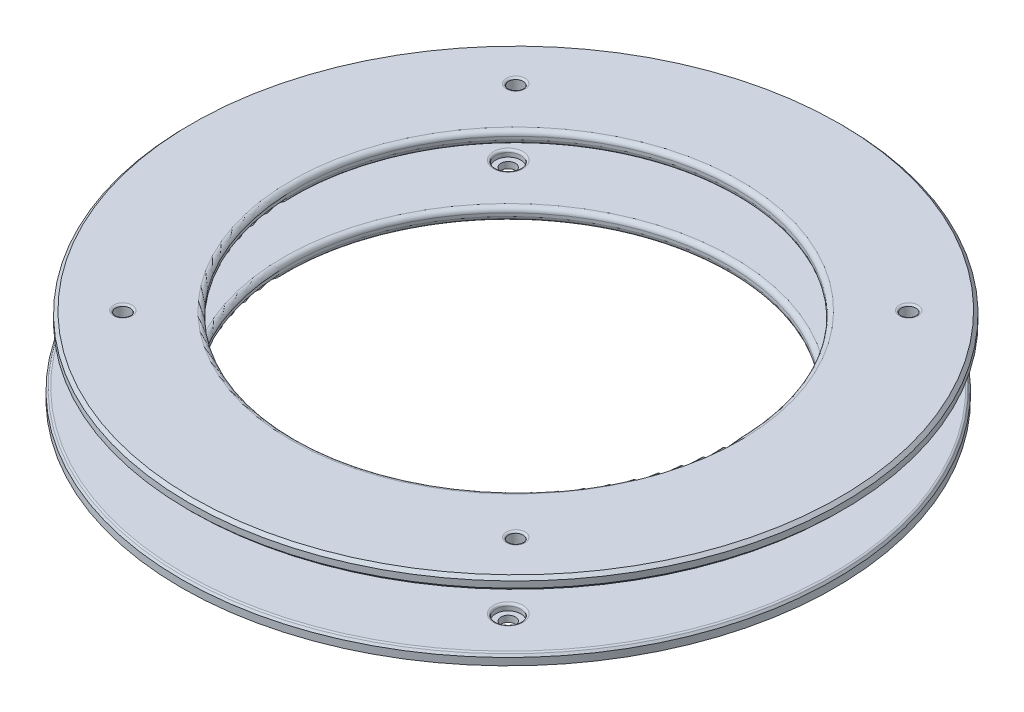
ISO-10303-21;
HEADER;
FILE_DESCRIPTION(('STEP AP214'),'2;1');
FILE_NAME('part.step','',(''),(''),'','','');
FILE_SCHEMA(('AUTOMOTIVE_DESIGN { 1 0 10303 214 1 1 1 1 }'));
ENDSEC;
DATA;
#1=APPLICATION_CONTEXT('core data for automotive mechanical design processes');
#2=APPLICATION_PROTOCOL_DEFINITION('international standard','automotive_design',2000,#1);
#3=PRODUCT_CONTEXT('',#1,'mechanical');
#4=PRODUCT('Part','Part','',(#3));
#5=PRODUCT_RELATED_PRODUCT_CATEGORY('part','',(#4));
#6=PRODUCT_DEFINITION_FORMATION('','',#4);
#7=PRODUCT_DEFINITION_CONTEXT('part definition',#1,'design');
#8=PRODUCT_DEFINITION('design','',#6,#7);
#9=PRODUCT_DEFINITION_SHAPE('','',#8);
#10=(LENGTH_UNIT() NAMED_UNIT(*) SI_UNIT(.MILLI.,.METRE.));
#11=(NAMED_UNIT(*) PLANE_ANGLE_UNIT() SI_UNIT($,.RADIAN.));
#12=(NAMED_UNIT(*) SI_UNIT($,.STERADIAN.) SOLID_ANGLE_UNIT());
#13=UNCERTAINTY_MEASURE_WITH_UNIT(LENGTH_MEASURE(1.E-05),#10,'distance_accuracy_value','');
#14=(GEOMETRIC_REPRESENTATION_CONTEXT(3) GLOBAL_UNCERTAINTY_ASSIGNED_CONTEXT((#13)) GLOBAL_UNIT_ASSIGNED_CONTEXT((#10,
#11,#12)) REPRESENTATION_CONTEXT('',''));
#15=CARTESIAN_POINT('',(0.,0.,0.));
#16=DIRECTION('',(0.,0.,1.));
#17=DIRECTION('',(1.,0.,0.));
#18=AXIS2_PLACEMENT_3D('',#15,#16,#17);
#19=CARTESIAN_POINT('',(-12.6429812739192,30.026931653807,102.095432399464));
#20=DIRECTION('',(0.,-1.,0.));
#21=DIRECTION('',(0.,0.,-1.));
#22=AXIS2_PLACEMENT_3D('',#19,#20,#21);
#23=CYLINDRICAL_SURFACE('',#22,104.);
#24=CARTESIAN_POINT('',(-12.6429812739192,27.026931653807,102.095432399464));
#25=DIRECTION('',(0.,1.,0.));
#26=DIRECTION('',(0.,0.,1.));
#27=AXIS2_PLACEMENT_3D('',#24,#25,#26);
#28=CIRCLE('',#27,104.);
#29=CARTESIAN_POINT('',(-12.6429812739192,27.026931653807,206.095432399464));
#30=VERTEX_POINT('',#29);
#31=EDGE_CURVE('P0_E41',#30,#30,#28,.T.);
#32=ORIENTED_EDGE('',*,*,#31,.T.);
#33=EDGE_LOOP('',(#32));
#34=FACE_BOUND('',#33,.T.);
#35=CARTESIAN_POINT('',(-12.6429812739192,29.026931653807,102.095432399464));
#36=DIRECTION('',(0.,1.,0.));
#37=DIRECTION('',(0.,0.,1.));
#38=AXIS2_PLACEMENT_3D('',#35,#36,#37);
#39=CIRCLE('',#38,104.);
#40=CARTESIAN_POINT('',(-12.6429812739192,29.026931653807,206.095432399464));
#41=VERTEX_POINT('',#40);
#42=EDGE_CURVE('P0_E44',#41,#41,#39,.F.);
#43=ORIENTED_EDGE('',*,*,#42,.T.);
#44=EDGE_LOOP('',(#43));
#45=FACE_BOUND('',#44,.T.);
#46=ADVANCED_FACE('P0_F15',(#34,#45),#23,.T.);
#47=CARTESIAN_POINT('',(-12.6429812739192,30.026931653807,102.095432399464));
#48=DIRECTION('',(0.,1.,0.));
#49=DIRECTION('',(0.,0.,1.));
#50=AXIS2_PLACEMENT_3D('',#47,#48,#49);
#51=PLANE('',#50);
#52=CARTESIAN_POINT('',(-75.1429812739192,30.026931653807,164.595432399464));
#53=DIRECTION('',(0.,1.,0.));
#54=DIRECTION('',(0.,0.,1.));
#55=AXIS2_PLACEMENT_3D('',#52,#53,#54);
#56=CIRCLE('',#55,2.97082039324993);
#57=CARTESIAN_POINT('',(-75.1429812739192,30.026931653807,167.566252792714));
#58=VERTEX_POINT('',#57);
#59=EDGE_CURVE('P0_E10',#58,#58,#56,.F.);
#60=ORIENTED_EDGE('',*,*,#59,.T.);
#61=EDGE_LOOP('',(#60));
#62=FACE_BOUND('',#61,.T.);
#63=CARTESIAN_POINT('',(49.8570187260808,30.026931653807,164.595432399464));
#64=DIRECTION('',(0.,1.,0.));
#65=DIRECTION('',(0.,0.,1.));
#66=AXIS2_PLACEMENT_3D('',#63,#64,#65);
#67=CIRCLE('',#66,2.97082039324992);
#68=CARTESIAN_POINT('',(49.8570187260808,30.026931653807,167.566252792714));
#69=VERTEX_POINT('',#68);
#70=EDGE_CURVE('P0_E22',#69,#69,#67,.F.);
#71=ORIENTED_EDGE('',*,*,#70,.T.);
#72=EDGE_LOOP('',(#71));
#73=FACE_BOUND('',#72,.T.);
#74=CARTESIAN_POINT('',(49.8570187260808,30.026931653807,39.5954323994644));
#75=DIRECTION('',(0.,1.,0.));
#76=DIRECTION('',(0.,0.,1.));
#77=AXIS2_PLACEMENT_3D('',#74,#75,#76);
#78=CIRCLE('',#77,2.97082039324992);
#79=CARTESIAN_POINT('',(49.8570187260808,30.026931653807,42.5662527927144));
#80=VERTEX_POINT('',#79);
#81=EDGE_CURVE('P0_E26',#80,#80,#78,.F.);
#82=ORIENTED_EDGE('',*,*,#81,.T.);
#83=EDGE_LOOP('',(#82));
#84=FACE_BOUND('',#83,.T.);
#85=CARTESIAN_POINT('',(-75.1429812739192,30.026931653807,39.5954323994644));
#86=DIRECTION('',(0.,1.,0.));
#87=DIRECTION('',(0.,0.,1.));
#88=AXIS2_PLACEMENT_3D('',#85,#86,#87);
#89=CIRCLE('',#88,2.97082039324993);
#90=CARTESIAN_POINT('',(-75.1429812739192,30.026931653807,42.5662527927144));
#91=VERTEX_POINT('',#90);
#92=EDGE_CURVE('P0_E30',#91,#91,#89,.F.);
#93=ORIENTED_EDGE('',*,*,#92,.T.);
#94=EDGE_LOOP('',(#93));
#95=FACE_BOUND('',#94,.T.);
#96=CARTESIAN_POINT('',(-12.6429812739192,30.026931653807,102.095432399464));
#97=DIRECTION('',(0.,1.,0.));
#98=DIRECTION('',(0.,0.,1.));
#99=AXIS2_PLACEMENT_3D('',#96,#97,#98);
#100=CIRCLE('',#99,103.);
#101=CARTESIAN_POINT('',(-12.6429812739192,30.026931653807,205.095432399464));
#102=VERTEX_POINT('',#101);
#103=EDGE_CURVE('P0_E35',#102,#102,#100,.T.);
#104=ORIENTED_EDGE('',*,*,#103,.T.);
#105=EDGE_LOOP('',(#104));
#106=FACE_BOUND('',#105,.T.);
#107=CARTESIAN_POINT('',(-12.6429812739192,30.026931653807,102.095432399464));
#108=DIRECTION('',(0.,1.,0.));
#109=DIRECTION('',(0.,0.,1.));
#110=AXIS2_PLACEMENT_3D('',#107,#108,#109);
#111=CIRCLE('',#110,71.5);
#112=CARTESIAN_POINT('',(-12.6429812739192,30.026931653807,173.595432399464));
#113=VERTEX_POINT('',#112);
#114=EDGE_CURVE('P0_E66',#113,#113,#111,.F.);
#115=ORIENTED_EDGE('',*,*,#114,.T.);
#116=EDGE_LOOP('',(#115));
#117=FACE_BOUND('',#116,.T.);
#118=ADVANCED_FACE('P0_F110',(#62,#73,#84,#95,#106,#117),#51,.T.);
#119=CARTESIAN_POINT('',(-12.6429812739192,26.026931653807,102.095432399464));
#120=DIRECTION('',(0.,1.,0.));
#121=DIRECTION('',(0.,0.,1.));
#122=AXIS2_PLACEMENT_3D('',#119,#120,#121);
#123=PLANE('',#122);
#124=CARTESIAN_POINT('',(-12.6429812739192,26.026931653807,102.095432399464));
#125=DIRECTION('',(0.,1.,0.));
#126=DIRECTION('',(0.,0.,1.));
#127=AXIS2_PLACEMENT_3D('',#124,#125,#126);
#128=CIRCLE('',#127,103.);
#129=CARTESIAN_POINT('',(-12.6429812739192,26.026931653807,205.095432399464));
#130=VERTEX_POINT('',#129);
#131=EDGE_CURVE('P0_E38',#130,#130,#128,.F.);
#132=ORIENTED_EDGE('',*,*,#131,.T.);
#133=EDGE_LOOP('',(#132));
#134=FACE_BOUND('',#133,.T.);
#135=CARTESIAN_POINT('',(49.8570187260808,26.026931653807,164.595432399464));
#136=DIRECTION('',(0.,-1.,0.));
#137=DIRECTION('',(0.,0.,-1.));
#138=AXIS2_PLACEMENT_3D('',#135,#136,#137);
#139=CIRCLE('',#138,2.84999999999999);
#140=CARTESIAN_POINT('',(49.8570187260808,26.026931653807,161.745432399464));
#141=VERTEX_POINT('',#140);
#142=EDGE_CURVE('P0_E84',#141,#141,#139,.T.);
#143=ORIENTED_EDGE('',*,*,#142,.F.);
#144=EDGE_LOOP('',(#143));
#145=FACE_BOUND('',#144,.T.);
#146=CARTESIAN_POINT('',(49.8570187260808,26.026931653807,39.5954323994644));
#147=DIRECTION('',(0.,-1.,0.));
#148=DIRECTION('',(0.,0.,-1.));
#149=AXIS2_PLACEMENT_3D('',#146,#147,#148);
#150=CIRCLE('',#149,2.84999999999999);
#151=CARTESIAN_POINT('',(49.8570187260808,26.026931653807,36.7454323994645));
#152=VERTEX_POINT('',#151);
#153=EDGE_CURVE('P0_E90',#152,#152,#150,.T.);
#154=ORIENTED_EDGE('',*,*,#153,.F.);
#155=EDGE_LOOP('',(#154));
#156=FACE_BOUND('',#155,.T.);
#157=CARTESIAN_POINT('',(-75.1429812739192,26.026931653807,39.5954323994644));
#158=DIRECTION('',(0.,-1.,0.));
#159=DIRECTION('',(0.,0.,-1.));
#160=AXIS2_PLACEMENT_3D('',#157,#158,#159);
#161=CIRCLE('',#160,2.84999999999999);
#162=CARTESIAN_POINT('',(-75.1429812739192,26.026931653807,36.7454323994645));
#163=VERTEX_POINT('',#162);
#164=EDGE_CURVE('P0_E78',#163,#163,#161,.T.);
#165=ORIENTED_EDGE('',*,*,#164,.F.);
#166=EDGE_LOOP('',(#165));
#167=FACE_BOUND('',#166,.T.);
#168=CARTESIAN_POINT('',(-75.1429812739192,26.026931653807,164.595432399464));
#169=DIRECTION('',(0.,-1.,0.));
#170=DIRECTION('',(0.,0.,-1.));
#171=AXIS2_PLACEMENT_3D('',#168,#169,#170);
#172=CIRCLE('',#171,2.84999999999999);
#173=CARTESIAN_POINT('',(-75.1429812739192,26.026931653807,161.745432399464));
#174=VERTEX_POINT('',#173);
#175=EDGE_CURVE('P0_E51',#174,#174,#172,.T.);
#176=ORIENTED_EDGE('',*,*,#175,.F.);
#177=EDGE_LOOP('',(#176));
#178=FACE_BOUND('',#177,.T.);
#179=CARTESIAN_POINT('',(-12.6429812739192,26.026931653807,102.095432399464));
#180=DIRECTION('',(0.,1.,0.));
#181=DIRECTION('',(0.,0.,1.));
#182=AXIS2_PLACEMENT_3D('',#179,#180,#181);
#183=CIRCLE('',#182,71.5);
#184=CARTESIAN_POINT('',(-12.6429812739192,26.026931653807,173.595432399464));
#185=VERTEX_POINT('',#184);
#186=EDGE_CURVE('P0_E47',#185,#185,#183,.T.);
#187=ORIENTED_EDGE('',*,*,#186,.T.);
#188=EDGE_LOOP('',(#187));
#189=FACE_BOUND('',#188,.T.);
#190=ADVANCED_FACE('P0_F106',(#134,#145,#156,#167,#178,#189),#123,.F.);
#191=CARTESIAN_POINT('',(-12.6429812739192,26.026931653807,102.095432399464));
#192=DIRECTION('',(0.,1.,0.));
#193=DIRECTION('',(0.,0.,1.));
#194=AXIS2_PLACEMENT_3D('',#191,#192,#193);
#195=CYLINDRICAL_SURFACE('',#194,70.);
#196=CARTESIAN_POINT('',(-12.6429812739192,28.526931653807,102.095432399464));
#197=DIRECTION('',(0.,1.,0.));
#198=DIRECTION('',(0.,0.,1.));
#199=AXIS2_PLACEMENT_3D('',#196,#197,#198);
#200=CIRCLE('',#199,70.);
#201=CARTESIAN_POINT('',(-12.6429812739192,28.526931653807,172.095432399464));
#202=VERTEX_POINT('',#201);
#203=EDGE_CURVE('P0_E69',#202,#202,#200,.T.);
#204=ORIENTED_EDGE('',*,*,#203,.T.);
#205=EDGE_LOOP('',(#204));
#206=FACE_BOUND('',#205,.T.);
#207=CARTESIAN_POINT('',(-12.6429812739192,27.526931653807,102.095432399464));
#208=DIRECTION('',(0.,1.,0.));
#209=DIRECTION('',(0.,0.,1.));
#210=AXIS2_PLACEMENT_3D('',#207,#208,#209);
#211=CIRCLE('',#210,70.);
#212=CARTESIAN_POINT('',(-12.6429812739192,27.526931653807,172.095432399464));
#213=VERTEX_POINT('',#212);
#214=EDGE_CURVE('P0_E62',#213,#213,#211,.F.);
#215=ORIENTED_EDGE('',*,*,#214,.T.);
#216=EDGE_LOOP('',(#215));
#217=FACE_BOUND('',#216,.T.);
#218=ADVANCED_FACE('P0_F109',(#206,#217),#195,.F.);
#219=CARTESIAN_POINT('',(-12.6429812739192,28.526931653807,102.095432399464));
#220=DIRECTION('',(0.,1.,0.));
#221=DIRECTION('',(0.,0.,1.));
#222=AXIS2_PLACEMENT_3D('',#219,#220,#221);
#223=TOROIDAL_SURFACE('',#222,71.5,1.5);
#224=ORIENTED_EDGE('',*,*,#114,.F.);
#225=EDGE_LOOP('',(#224));
#226=FACE_BOUND('',#225,.T.);
#227=ORIENTED_EDGE('',*,*,#203,.F.);
#228=EDGE_LOOP('',(#227));
#229=FACE_BOUND('',#228,.T.);
#230=ADVANCED_FACE('P0_F122',(#226,#229),#223,.T.);
#231=CARTESIAN_POINT('',(-12.6429812739192,27.526931653807,102.095432399464));
#232=DIRECTION('',(0.,1.,0.));
#233=DIRECTION('',(0.,0.,1.));
#234=AXIS2_PLACEMENT_3D('',#231,#232,#233);
#235=TOROIDAL_SURFACE('',#234,71.5,1.5);
#236=ORIENTED_EDGE('',*,*,#214,.F.);
#237=EDGE_LOOP('',(#236));
#238=FACE_BOUND('',#237,.T.);
#239=ORIENTED_EDGE('',*,*,#186,.F.);
#240=EDGE_LOOP('',(#239));
#241=FACE_BOUND('',#240,.T.);
#242=ADVANCED_FACE('P0_F119',(#238,#241),#235,.T.);
#243=CARTESIAN_POINT('',(-75.1429812739192,29.526931653807,164.595432399464));
#244=DIRECTION('',(0.,-1.,0.));
#245=DIRECTION('',(0.,0.,-1.));
#246=AXIS2_PLACEMENT_3D('',#243,#244,#245);
#247=PLANE('',#246);
#248=CARTESIAN_POINT('',(-75.1429812739192,29.526931653807,164.595432399464));
#249=DIRECTION('',(0.,-1.,0.));
#250=DIRECTION('',(0.,0.,-1.));
#251=AXIS2_PLACEMENT_3D('',#248,#249,#250);
#252=CIRCLE('',#251,2.84999999999999);
#253=CARTESIAN_POINT('',(-75.1429812739192,29.526931653807,161.745432399464));
#254=VERTEX_POINT('',#253);
#255=EDGE_CURVE('P0_E63',#254,#254,#252,.T.);
#256=ORIENTED_EDGE('',*,*,#255,.T.);
#257=EDGE_LOOP('',(#256));
#258=FACE_BOUND('',#257,.T.);
#259=CARTESIAN_POINT('',(-75.1429812739192,29.526931653807,164.595432399464));
#260=DIRECTION('',(0.,-1.,0.));
#261=DIRECTION('',(0.,0.,-1.));
#262=AXIS2_PLACEMENT_3D('',#259,#260,#261);
#263=CIRCLE('',#262,2.29999999999999);
#264=CARTESIAN_POINT('',(-75.1429812739192,29.526931653807,162.295432399464));
#265=VERTEX_POINT('',#264);
#266=EDGE_CURVE('P0_E59',#265,#265,#263,.F.);
#267=ORIENTED_EDGE('',*,*,#266,.T.);
#268=EDGE_LOOP('',(#267));
#269=FACE_BOUND('',#268,.T.);
#270=ADVANCED_FACE('P0_F121',(#258,#269),#247,.T.);
#271=CARTESIAN_POINT('',(-75.1429812739192,29.526931653807,164.595432399464));
#272=DIRECTION('',(0.,-1.,0.));
#273=DIRECTION('',(0.,0.,-1.));
#274=AXIS2_PLACEMENT_3D('',#271,#272,#273);
#275=CYLINDRICAL_SURFACE('',#274,2.84999999999999);
#276=ORIENTED_EDGE('',*,*,#255,.F.);
#277=EDGE_LOOP('',(#276));
#278=FACE_BOUND('',#277,.T.);
#279=ORIENTED_EDGE('',*,*,#175,.T.);
#280=EDGE_LOOP('',(#279));
#281=FACE_BOUND('',#280,.T.);
#282=ADVANCED_FACE('P0_F130',(#278,#281),#275,.F.);
#283=CARTESIAN_POINT('',(-75.1429812739192,29.526931653807,39.5954323994644));
#284=DIRECTION('',(0.,-1.,0.));
#285=DIRECTION('',(0.,0.,-1.));
#286=AXIS2_PLACEMENT_3D('',#283,#284,#285);
#287=PLANE('',#286);
#288=CARTESIAN_POINT('',(-75.1429812739192,29.526931653807,39.5954323994644));
#289=DIRECTION('',(0.,-1.,0.));
#290=DIRECTION('',(0.,0.,-1.));
#291=AXIS2_PLACEMENT_3D('',#288,#289,#290);
#292=CIRCLE('',#291,2.84999999999999);
#293=CARTESIAN_POINT('',(-75.1429812739192,29.526931653807,36.7454323994645));
#294=VERTEX_POINT('',#293);
#295=EDGE_CURVE('P0_E58',#294,#294,#292,.T.);
#296=ORIENTED_EDGE('',*,*,#295,.T.);
#297=EDGE_LOOP('',(#296));
#298=FACE_BOUND('',#297,.T.);
#299=CARTESIAN_POINT('',(-75.1429812739192,29.526931653807,39.5954323994644));
#300=DIRECTION('',(0.,-1.,0.));
#301=DIRECTION('',(0.,0.,-1.));
#302=AXIS2_PLACEMENT_3D('',#299,#300,#301);
#303=CIRCLE('',#302,2.29999999999999);
#304=CARTESIAN_POINT('',(-75.1429812739192,29.526931653807,37.2954323994645));
#305=VERTEX_POINT('',#304);
#306=EDGE_CURVE('P0_E55',#305,#305,#303,.F.);
#307=ORIENTED_EDGE('',*,*,#306,.T.);
#308=EDGE_LOOP('',(#307));
#309=FACE_BOUND('',#308,.T.);
#310=ADVANCED_FACE('P0_F150',(#298,#309),#287,.T.);
#311=CARTESIAN_POINT('',(-75.1429812739192,29.526931653807,39.5954323994644));
#312=DIRECTION('',(0.,-1.,0.));
#313=DIRECTION('',(0.,0.,-1.));
#314=AXIS2_PLACEMENT_3D('',#311,#312,#313);
#315=CYLINDRICAL_SURFACE('',#314,2.84999999999999);
#316=ORIENTED_EDGE('',*,*,#295,.F.);
#317=EDGE_LOOP('',(#316));
#318=FACE_BOUND('',#317,.T.);
#319=ORIENTED_EDGE('',*,*,#164,.T.);
#320=EDGE_LOOP('',(#319));
#321=FACE_BOUND('',#320,.T.);
#322=ADVANCED_FACE('P0_F153',(#318,#321),#315,.F.);
#323=CARTESIAN_POINT('',(49.8570187260808,29.526931653807,39.5954323994644));
#324=DIRECTION('',(0.,-1.,0.));
#325=DIRECTION('',(0.,0.,-1.));
#326=AXIS2_PLACEMENT_3D('',#323,#324,#325);
#327=PLANE('',#326);
#328=CARTESIAN_POINT('',(49.8570187260808,29.526931653807,39.5954323994644));
#329=DIRECTION('',(0.,-1.,0.));
#330=DIRECTION('',(0.,0.,-1.));
#331=AXIS2_PLACEMENT_3D('',#328,#329,#330);
#332=CIRCLE('',#331,2.84999999999999);
#333=CARTESIAN_POINT('',(49.8570187260808,29.526931653807,36.7454323994645));
#334=VERTEX_POINT('',#333);
#335=EDGE_CURVE('P0_E81',#334,#334,#332,.T.);
#336=ORIENTED_EDGE('',*,*,#335,.T.);
#337=EDGE_LOOP('',(#336));
#338=FACE_BOUND('',#337,.T.);
#339=CARTESIAN_POINT('',(49.8570187260808,29.526931653807,39.5954323994644));
#340=DIRECTION('',(0.,-1.,0.));
#341=DIRECTION('',(0.,0.,-1.));
#342=AXIS2_PLACEMENT_3D('',#339,#340,#341);
#343=CIRCLE('',#342,2.29999999999998);
#344=CARTESIAN_POINT('',(49.8570187260808,29.526931653807,37.2954323994645));
#345=VERTEX_POINT('',#344);
#346=EDGE_CURVE('P0_E52',#345,#345,#343,.F.);
#347=ORIENTED_EDGE('',*,*,#346,.T.);
#348=EDGE_LOOP('',(#347));
#349=FACE_BOUND('',#348,.T.);
#350=ADVANCED_FACE('P0_F96',(#338,#349),#327,.T.);
#351=CARTESIAN_POINT('',(49.8570187260808,29.526931653807,39.5954323994644));
#352=DIRECTION('',(0.,-1.,0.));
#353=DIRECTION('',(0.,0.,-1.));
#354=AXIS2_PLACEMENT_3D('',#351,#352,#353);
#355=CYLINDRICAL_SURFACE('',#354,2.84999999999999);
#356=ORIENTED_EDGE('',*,*,#335,.F.);
#357=EDGE_LOOP('',(#356));
#358=FACE_BOUND('',#357,.T.);
#359=ORIENTED_EDGE('',*,*,#153,.T.);
#360=EDGE_LOOP('',(#359));
#361=FACE_BOUND('',#360,.T.);
#362=ADVANCED_FACE('P0_F99',(#358,#361),#355,.F.);
#363=CARTESIAN_POINT('',(49.8570187260808,29.526931653807,164.595432399464));
#364=DIRECTION('',(0.,-1.,0.));
#365=DIRECTION('',(0.,0.,-1.));
#366=AXIS2_PLACEMENT_3D('',#363,#364,#365);
#367=PLANE('',#366);
#368=CARTESIAN_POINT('',(49.8570187260808,29.526931653807,164.595432399464));
#369=DIRECTION('',(0.,-1.,0.));
#370=DIRECTION('',(0.,0.,-1.));
#371=AXIS2_PLACEMENT_3D('',#368,#369,#370);
#372=CIRCLE('',#371,2.84999999999999);
#373=CARTESIAN_POINT('',(49.8570187260808,29.526931653807,161.745432399464));
#374=VERTEX_POINT('',#373);
#375=EDGE_CURVE('P0_E87',#374,#374,#372,.T.);
#376=ORIENTED_EDGE('',*,*,#375,.T.);
#377=EDGE_LOOP('',(#376));
#378=FACE_BOUND('',#377,.T.);
#379=CARTESIAN_POINT('',(49.8570187260808,29.526931653807,164.595432399464));
#380=DIRECTION('',(0.,-1.,0.));
#381=DIRECTION('',(0.,0.,-1.));
#382=AXIS2_PLACEMENT_3D('',#379,#380,#381);
#383=CIRCLE('',#382,2.29999999999998);
#384=CARTESIAN_POINT('',(49.8570187260808,29.526931653807,162.295432399464));
#385=VERTEX_POINT('',#384);
#386=EDGE_CURVE('P0_E48',#385,#385,#383,.F.);
#387=ORIENTED_EDGE('',*,*,#386,.T.);
#388=EDGE_LOOP('',(#387));
#389=FACE_BOUND('',#388,.T.);
#390=ADVANCED_FACE('P0_F102',(#378,#389),#367,.T.);
#391=CARTESIAN_POINT('',(49.8570187260808,29.526931653807,164.595432399464));
#392=DIRECTION('',(0.,-1.,0.));
#393=DIRECTION('',(0.,0.,-1.));
#394=AXIS2_PLACEMENT_3D('',#391,#392,#393);
#395=CYLINDRICAL_SURFACE('',#394,2.84999999999999);
#396=ORIENTED_EDGE('',*,*,#375,.F.);
#397=EDGE_LOOP('',(#396));
#398=FACE_BOUND('',#397,.T.);
#399=ORIENTED_EDGE('',*,*,#142,.T.);
#400=EDGE_LOOP('',(#399));
#401=FACE_BOUND('',#400,.T.);
#402=ADVANCED_FACE('P0_F160',(#398,#401),#395,.F.);
#403=CARTESIAN_POINT('',(-12.6429812739192,27.026931653807,102.095432399464));
#404=DIRECTION('',(0.,1.,0.));
#405=DIRECTION('',(0.,0.,1.));
#406=AXIS2_PLACEMENT_3D('',#403,#404,#405);
#407=CONICAL_SURFACE('',#406,104.,0.785398163397448);
#408=ORIENTED_EDGE('',*,*,#131,.F.);
#409=EDGE_LOOP('',(#408));
#410=FACE_BOUND('',#409,.T.);
#411=ORIENTED_EDGE('',*,*,#31,.F.);
#412=EDGE_LOOP('',(#411));
#413=FACE_BOUND('',#412,.T.);
#414=ADVANCED_FACE('P0_F163',(#410,#413),#407,.T.);
#415=CARTESIAN_POINT('',(-12.6429812739192,30.026931653807,102.095432399464));
#416=DIRECTION('',(0.,-1.,0.));
#417=DIRECTION('',(0.,0.,-1.));
#418=AXIS2_PLACEMENT_3D('',#415,#416,#417);
#419=CONICAL_SURFACE('',#418,103.,0.785398163397455);
#420=ORIENTED_EDGE('',*,*,#42,.F.);
#421=EDGE_LOOP('',(#420));
#422=FACE_BOUND('',#421,.T.);
#423=ORIENTED_EDGE('',*,*,#103,.F.);
#424=EDGE_LOOP('',(#423));
#425=FACE_BOUND('',#424,.T.);
#426=ADVANCED_FACE('P0_F198',(#422,#425),#419,.T.);
#427=CARTESIAN_POINT('',(-75.1429812739192,29.326931653807,39.5954323994644));
#428=DIRECTION('',(0.,1.,0.));
#429=DIRECTION('',(0.,0.,1.));
#430=AXIS2_PLACEMENT_3D('',#427,#428,#429);
#431=TOROIDAL_SURFACE('',#430,2.97082039324993,0.7);
#432=ORIENTED_EDGE('',*,*,#92,.F.);
#433=EDGE_LOOP('',(#432));
#434=FACE_BOUND('',#433,.T.);
#435=ORIENTED_EDGE('',*,*,#306,.F.);
#436=EDGE_LOOP('',(#435));
#437=FACE_BOUND('',#436,.T.);
#438=ADVANCED_FACE('P0_F206',(#434,#437),#431,.T.);
#439=CARTESIAN_POINT('',(49.8570187260808,29.326931653807,39.5954323994644));
#440=DIRECTION('',(0.,1.,0.));
#441=DIRECTION('',(0.,0.,1.));
#442=AXIS2_PLACEMENT_3D('',#439,#440,#441);
#443=TOROIDAL_SURFACE('',#442,2.97082039324992,0.7);
#444=ORIENTED_EDGE('',*,*,#81,.F.);
#445=EDGE_LOOP('',(#444));
#446=FACE_BOUND('',#445,.T.);
#447=ORIENTED_EDGE('',*,*,#346,.F.);
#448=EDGE_LOOP('',(#447));
#449=FACE_BOUND('',#448,.T.);
#450=ADVANCED_FACE('P0_F215',(#446,#449),#443,.T.);
#451=CARTESIAN_POINT('',(49.8570187260808,29.326931653807,164.595432399464));
#452=DIRECTION('',(0.,1.,0.));
#453=DIRECTION('',(0.,0.,1.));
#454=AXIS2_PLACEMENT_3D('',#451,#452,#453);
#455=TOROIDAL_SURFACE('',#454,2.97082039324992,0.7);
#456=ORIENTED_EDGE('',*,*,#70,.F.);
#457=EDGE_LOOP('',(#456));
#458=FACE_BOUND('',#457,.T.);
#459=ORIENTED_EDGE('',*,*,#386,.F.);
#460=EDGE_LOOP('',(#459));
#461=FACE_BOUND('',#460,.T.);
#462=ADVANCED_FACE('P0_F224',(#458,#461),#455,.T.);
#463=CARTESIAN_POINT('',(-75.1429812739192,29.326931653807,164.595432399464));
#464=DIRECTION('',(0.,1.,0.));
#465=DIRECTION('',(0.,0.,1.));
#466=AXIS2_PLACEMENT_3D('',#463,#464,#465);
#467=TOROIDAL_SURFACE('',#466,2.97082039324993,0.7);
#468=ORIENTED_EDGE('',*,*,#59,.F.);
#469=EDGE_LOOP('',(#468));
#470=FACE_BOUND('',#469,.T.);
#471=ORIENTED_EDGE('',*,*,#266,.F.);
#472=EDGE_LOOP('',(#471));
#473=FACE_BOUND('',#472,.T.);
#474=ADVANCED_FACE('P0_F17',(#470,#473),#467,.T.);
#475=CLOSED_SHELL('',(#46,#118,#190,#218,#230,#242,#270,#282,#310,#322,#350,#362,#390,#402,#414,
#426,#438,#450,#462,#474));
#476=MANIFOLD_SOLID_BREP('P0_B1',#475);
#477=CARTESIAN_POINT('',(-12.3570679570548,10.4309529047459,104.779388799216));
#478=DIRECTION('',(0.,-1.,0.));
#479=DIRECTION('',(0.,0.,-1.));
#480=AXIS2_PLACEMENT_3D('',#477,#478,#479);
#481=CYLINDRICAL_SURFACE('',#480,104.);
#482=CARTESIAN_POINT('',(-12.3570679570548,7.13116044295564,104.779388799216));
#483=DIRECTION('',(0.,1.,0.));
#484=DIRECTION('',(0.,0.,1.));
#485=AXIS2_PLACEMENT_3D('',#482,#483,#484);
#486=CIRCLE('',#485,104.);
#487=CARTESIAN_POINT('',(-12.3570679570548,7.13116044295564,208.779388799216));
#488=VERTEX_POINT('',#487);
#489=EDGE_CURVE('P1_E58',#488,#488,#486,.T.);
#490=ORIENTED_EDGE('',*,*,#489,.T.);
#491=EDGE_LOOP('',(#490));
#492=FACE_BOUND('',#491,.T.);
#493=CARTESIAN_POINT('',(-12.3570679570548,9.43095290474591,104.779388799216));
#494=DIRECTION('',(0.,1.,0.));
#495=DIRECTION('',(0.,0.,1.));
#496=AXIS2_PLACEMENT_3D('',#493,#494,#495);
#497=CIRCLE('',#496,104.);
#498=CARTESIAN_POINT('',(-12.3570679570548,9.43095290474591,208.779388799216));
#499=VERTEX_POINT('',#498);
#500=EDGE_CURVE('P1_E61',#499,#499,#497,.F.);
#501=ORIENTED_EDGE('',*,*,#500,.T.);
#502=EDGE_LOOP('',(#501));
#503=FACE_BOUND('',#502,.T.);
#504=ADVANCED_FACE('P1_F14',(#492,#503),#481,.T.);
#505=CARTESIAN_POINT('',(-12.3570679570548,10.4309529047459,104.779388799216));
#506=DIRECTION('',(0.,1.,0.));
#507=DIRECTION('',(0.,0.,1.));
#508=AXIS2_PLACEMENT_3D('',#505,#506,#507);
#509=PLANE('',#508);
#510=CARTESIAN_POINT('',(-12.3570679570548,10.4309529047459,104.779388799216));
#511=DIRECTION('',(0.,1.,0.));
#512=DIRECTION('',(0.,0.,1.));
#513=AXIS2_PLACEMENT_3D('',#510,#511,#512);
#514=CIRCLE('',#513,102.935395526404);
#515=CARTESIAN_POINT('',(-12.3570679570548,10.4309529047459,207.71478432562));
#516=VERTEX_POINT('',#515);
#517=EDGE_CURVE('P1_E21',#516,#516,#514,.T.);
#518=ORIENTED_EDGE('',*,*,#517,.T.);
#519=EDGE_LOOP('',(#518));
#520=FACE_BOUND('',#519,.T.);
#521=CARTESIAN_POINT('',(-74.8570679570548,10.4309529047459,167.279388799216));
#522=DIRECTION('',(0.,1.,0.));
#523=DIRECTION('',(0.,0.,1.));
#524=AXIS2_PLACEMENT_3D('',#521,#522,#523);
#525=CIRCLE('',#524,4.7);
#526=CARTESIAN_POINT('',(-74.8570679570548,10.4309529047459,171.979388799216));
#527=VERTEX_POINT('',#526);
#528=EDGE_CURVE('P1_E43',#527,#527,#525,.F.);
#529=ORIENTED_EDGE('',*,*,#528,.T.);
#530=EDGE_LOOP('',(#529));
#531=FACE_BOUND('',#530,.T.);
#532=CARTESIAN_POINT('',(-74.8570679570548,10.4309529047459,42.2793887992157));
#533=DIRECTION('',(0.,1.,0.));
#534=DIRECTION('',(0.,0.,1.));
#535=AXIS2_PLACEMENT_3D('',#532,#533,#534);
#536=CIRCLE('',#535,4.7);
#537=CARTESIAN_POINT('',(-74.8570679570548,10.4309529047459,46.9793887992157));
#538=VERTEX_POINT('',#537);
#539=EDGE_CURVE('P1_E46',#538,#538,#536,.F.);
#540=ORIENTED_EDGE('',*,*,#539,.T.);
#541=EDGE_LOOP('',(#540));
#542=FACE_BOUND('',#541,.T.);
#543=CARTESIAN_POINT('',(50.1429320429452,10.4309529047459,42.2793887992157));
#544=DIRECTION('',(0.,1.,0.));
#545=DIRECTION('',(0.,0.,1.));
#546=AXIS2_PLACEMENT_3D('',#543,#544,#545);
#547=CIRCLE('',#546,4.7);
#548=CARTESIAN_POINT('',(50.1429320429452,10.4309529047459,46.9793887992157));
#549=VERTEX_POINT('',#548);
#550=EDGE_CURVE('P1_E49',#549,#549,#547,.F.);
#551=ORIENTED_EDGE('',*,*,#550,.T.);
#552=EDGE_LOOP('',(#551));
#553=FACE_BOUND('',#552,.T.);
#554=CARTESIAN_POINT('',(50.1429320429452,10.4309529047459,167.279388799216));
#555=DIRECTION('',(0.,1.,0.));
#556=DIRECTION('',(0.,0.,1.));
#557=AXIS2_PLACEMENT_3D('',#554,#555,#556);
#558=CIRCLE('',#557,4.7);
#559=CARTESIAN_POINT('',(50.1429320429452,10.4309529047459,171.979388799216));
#560=VERTEX_POINT('',#559);
#561=EDGE_CURVE('P1_E52',#560,#560,#558,.F.);
#562=ORIENTED_EDGE('',*,*,#561,.T.);
#563=EDGE_LOOP('',(#562));
#564=FACE_BOUND('',#563,.T.);
#565=CARTESIAN_POINT('',(-12.3570679570548,10.4309529047459,104.779388799216));
#566=DIRECTION('',(0.,1.,0.));
#567=DIRECTION('',(0.,0.,1.));
#568=AXIS2_PLACEMENT_3D('',#565,#566,#567);
#569=CIRCLE('',#568,71.5);
#570=CARTESIAN_POINT('',(-12.3570679570548,10.4309529047459,176.279388799216));
#571=VERTEX_POINT('',#570);
#572=EDGE_CURVE('P1_E67',#571,#571,#569,.F.);
#573=ORIENTED_EDGE('',*,*,#572,.T.);
#574=EDGE_LOOP('',(#573));
#575=FACE_BOUND('',#574,.T.);
#576=ADVANCED_FACE('P1_F132',(#520,#531,#542,#553,#564,#575),#509,.T.);
#577=CARTESIAN_POINT('',(-12.3570679570548,6.43095290474594,104.779388799216));
#578=DIRECTION('',(0.,1.,0.));
#579=DIRECTION('',(0.,0.,1.));
#580=AXIS2_PLACEMENT_3D('',#577,#578,#579);
#581=PLANE('',#580);
#582=CARTESIAN_POINT('',(-12.3570679570548,6.43095290474594,104.779388799216));
#583=DIRECTION('',(0.,1.,0.));
#584=DIRECTION('',(0.,0.,1.));
#585=AXIS2_PLACEMENT_3D('',#582,#583,#584);
#586=CIRCLE('',#585,102.779290847785);
#587=CARTESIAN_POINT('',(-12.3570679570548,6.43095290474594,207.558679647));
#588=VERTEX_POINT('',#587);
#589=EDGE_CURVE('P1_E29',#588,#588,#586,.F.);
#590=ORIENTED_EDGE('',*,*,#589,.T.);
#591=EDGE_LOOP('',(#590));
#592=FACE_BOUND('',#591,.T.);
#593=CARTESIAN_POINT('',(-12.3570679570548,6.43095290474594,104.779388799216));
#594=DIRECTION('',(0.,1.,0.));
#595=DIRECTION('',(0.,0.,1.));
#596=AXIS2_PLACEMENT_3D('',#593,#594,#595);
#597=CIRCLE('',#596,71.5);
#598=CARTESIAN_POINT('',(-12.3570679570548,6.43095290474594,176.279388799216));
#599=VERTEX_POINT('',#598);
#600=EDGE_CURVE('P1_E64',#599,#599,#597,.T.);
#601=ORIENTED_EDGE('',*,*,#600,.T.);
#602=EDGE_LOOP('',(#601));
#603=FACE_BOUND('',#602,.T.);
#604=CARTESIAN_POINT('',(-74.8570679570548,6.43095290474594,42.2793887992157));
#605=DIRECTION('',(0.,1.,0.));
#606=DIRECTION('',(0.,0.,1.));
#607=AXIS2_PLACEMENT_3D('',#604,#605,#606);
#608=CIRCLE('',#607,2.3);
#609=CARTESIAN_POINT('',(-74.8570679570548,6.43095290474594,44.5793887992157));
#610=VERTEX_POINT('',#609);
#611=EDGE_CURVE('P1_E103',#610,#610,#608,.T.);
#612=ORIENTED_EDGE('',*,*,#611,.T.);
#613=EDGE_LOOP('',(#612));
#614=FACE_BOUND('',#613,.T.);
#615=CARTESIAN_POINT('',(50.1429320429452,6.43095290474594,42.2793887992157));
#616=DIRECTION('',(0.,1.,0.));
#617=DIRECTION('',(0.,0.,1.));
#618=AXIS2_PLACEMENT_3D('',#615,#616,#617);
#619=CIRCLE('',#618,2.3);
#620=CARTESIAN_POINT('',(50.1429320429452,6.43095290474594,44.5793887992157));
#621=VERTEX_POINT('',#620);
#622=EDGE_CURVE('P1_E94',#621,#621,#619,.T.);
#623=ORIENTED_EDGE('',*,*,#622,.T.);
#624=EDGE_LOOP('',(#623));
#625=FACE_BOUND('',#624,.T.);
#626=CARTESIAN_POINT('',(50.1429320429452,6.43095290474594,167.279388799216));
#627=DIRECTION('',(0.,1.,0.));
#628=DIRECTION('',(0.,0.,1.));
#629=AXIS2_PLACEMENT_3D('',#626,#627,#628);
#630=CIRCLE('',#629,2.3);
#631=CARTESIAN_POINT('',(50.1429320429452,6.43095290474594,169.579388799216));
#632=VERTEX_POINT('',#631);
#633=EDGE_CURVE('P1_E85',#632,#632,#630,.T.);
#634=ORIENTED_EDGE('',*,*,#633,.T.);
#635=EDGE_LOOP('',(#634));
#636=FACE_BOUND('',#635,.T.);
#637=CARTESIAN_POINT('',(-74.8570679570548,6.43095290474594,167.279388799216));
#638=DIRECTION('',(0.,1.,0.));
#639=DIRECTION('',(0.,0.,1.));
#640=AXIS2_PLACEMENT_3D('',#637,#638,#639);
#641=CIRCLE('',#640,2.3);
#642=CARTESIAN_POINT('',(-74.8570679570548,6.43095290474594,169.579388799216));
#643=VERTEX_POINT('',#642);
#644=EDGE_CURVE('P1_E76',#643,#643,#641,.T.);
#645=ORIENTED_EDGE('',*,*,#644,.T.);
#646=EDGE_LOOP('',(#645));
#647=FACE_BOUND('',#646,.T.);
#648=ADVANCED_FACE('P1_F138',(#592,#603,#614,#625,#636,#647),#581,.F.);
#649=CARTESIAN_POINT('',(-74.8570679570548,10.4309529047459,167.279388799216));
#650=DIRECTION('',(0.,1.,0.));
#651=DIRECTION('',(0.,0.,1.));
#652=AXIS2_PLACEMENT_3D('',#649,#650,#651);
#653=CYLINDRICAL_SURFACE('',#652,2.3);
#654=ORIENTED_EDGE('',*,*,#644,.F.);
#655=EDGE_LOOP('',(#654));
#656=FACE_BOUND('',#655,.T.);
#657=CARTESIAN_POINT('',(-74.8570679570548,8.43095290474594,167.279388799216));
#658=DIRECTION('',(0.,1.,0.));
#659=DIRECTION('',(0.,0.,1.));
#660=AXIS2_PLACEMENT_3D('',#657,#658,#659);
#661=CIRCLE('',#660,2.3);
#662=CARTESIAN_POINT('',(-74.8570679570548,8.43095290474594,169.579388799216));
#663=VERTEX_POINT('',#662);
#664=EDGE_CURVE('P1_E79',#663,#663,#661,.T.);
#665=ORIENTED_EDGE('',*,*,#664,.T.);
#666=EDGE_LOOP('',(#665));
#667=FACE_BOUND('',#666,.T.);
#668=ADVANCED_FACE('P1_F192',(#656,#667),#653,.F.);
#669=CARTESIAN_POINT('',(-72.5570679570548,8.43095290474594,167.279388799216));
#670=DIRECTION('',(0.,-1.,0.));
#671=DIRECTION('',(0.,0.,-1.));
#672=AXIS2_PLACEMENT_3D('',#669,#670,#671);
#673=PLANE('',#672);
#674=ORIENTED_EDGE('',*,*,#664,.F.);
#675=EDGE_LOOP('',(#674));
#676=FACE_BOUND('',#675,.T.);
#677=CARTESIAN_POINT('',(-74.8570679570548,8.43095290474594,167.279388799216));
#678=DIRECTION('',(0.,1.,0.));
#679=DIRECTION('',(0.,0.,1.));
#680=AXIS2_PLACEMENT_3D('',#677,#678,#679);
#681=CIRCLE('',#680,4.);
#682=CARTESIAN_POINT('',(-74.8570679570548,8.43095290474594,171.279388799216));
#683=VERTEX_POINT('',#682);
#684=EDGE_CURVE('P1_E82',#683,#683,#681,.T.);
#685=ORIENTED_EDGE('',*,*,#684,.T.);
#686=EDGE_LOOP('',(#685));
#687=FACE_BOUND('',#686,.T.);
#688=ADVANCED_FACE('P1_F205',(#676,#687),#673,.F.);
#689=CARTESIAN_POINT('',(-74.8570679570548,10.4309529047459,167.279388799216));
#690=DIRECTION('',(0.,1.,0.));
#691=DIRECTION('',(0.,0.,1.));
#692=AXIS2_PLACEMENT_3D('',#689,#690,#691);
#693=CYLINDRICAL_SURFACE('',#692,4.);
#694=CARTESIAN_POINT('',(-74.8570679570548,9.73095290474594,167.279388799216));
#695=DIRECTION('',(0.,1.,0.));
#696=DIRECTION('',(0.,0.,1.));
#697=AXIS2_PLACEMENT_3D('',#694,#695,#696);
#698=CIRCLE('',#697,4.);
#699=CARTESIAN_POINT('',(-74.8570679570548,9.73095290474594,171.279388799216));
#700=VERTEX_POINT('',#699);
#701=EDGE_CURVE('P1_E55',#700,#700,#698,.T.);
#702=ORIENTED_EDGE('',*,*,#701,.T.);
#703=EDGE_LOOP('',(#702));
#704=FACE_BOUND('',#703,.T.);
#705=ORIENTED_EDGE('',*,*,#684,.F.);
#706=EDGE_LOOP('',(#705));
#707=FACE_BOUND('',#706,.T.);
#708=ADVANCED_FACE('P1_F211',(#704,#707),#693,.F.);
#709=CARTESIAN_POINT('',(50.1429320429452,10.4309529047459,167.279388799216));
#710=DIRECTION('',(0.,1.,0.));
#711=DIRECTION('',(0.,0.,1.));
#712=AXIS2_PLACEMENT_3D('',#709,#710,#711);
#713=CYLINDRICAL_SURFACE('',#712,2.3);
#714=ORIENTED_EDGE('',*,*,#633,.F.);
#715=EDGE_LOOP('',(#714));
#716=FACE_BOUND('',#715,.T.);
#717=CARTESIAN_POINT('',(50.1429320429452,8.43095290474594,167.279388799216));
#718=DIRECTION('',(0.,1.,0.));
#719=DIRECTION('',(0.,0.,1.));
#720=AXIS2_PLACEMENT_3D('',#717,#718,#719);
#721=CIRCLE('',#720,2.3);
#722=CARTESIAN_POINT('',(50.1429320429452,8.43095290474594,169.579388799216));
#723=VERTEX_POINT('',#722);
#724=EDGE_CURVE('P1_E88',#723,#723,#721,.T.);
#725=ORIENTED_EDGE('',*,*,#724,.T.);
#726=EDGE_LOOP('',(#725));
#727=FACE_BOUND('',#726,.T.);
#728=ADVANCED_FACE('P1_F216',(#716,#727),#713,.F.);
#729=CARTESIAN_POINT('',(52.4429320429452,8.43095290474594,167.279388799216));
#730=DIRECTION('',(0.,-1.,0.));
#731=DIRECTION('',(0.,0.,-1.));
#732=AXIS2_PLACEMENT_3D('',#729,#730,#731);
#733=PLANE('',#732);
#734=ORIENTED_EDGE('',*,*,#724,.F.);
#735=EDGE_LOOP('',(#734));
#736=FACE_BOUND('',#735,.T.);
#737=CARTESIAN_POINT('',(50.1429320429452,8.43095290474594,167.279388799216));
#738=DIRECTION('',(0.,1.,0.));
#739=DIRECTION('',(0.,0.,1.));
#740=AXIS2_PLACEMENT_3D('',#737,#738,#739);
#741=CIRCLE('',#740,4.);
#742=CARTESIAN_POINT('',(50.1429320429452,8.43095290474594,171.279388799216));
#743=VERTEX_POINT('',#742);
#744=EDGE_CURVE('P1_E91',#743,#743,#741,.T.);
#745=ORIENTED_EDGE('',*,*,#744,.T.);
#746=EDGE_LOOP('',(#745));
#747=FACE_BOUND('',#746,.T.);
#748=ADVANCED_FACE('P1_F222',(#736,#747),#733,.F.);
#749=CARTESIAN_POINT('',(50.1429320429452,10.4309529047459,167.279388799216));
#750=DIRECTION('',(0.,1.,0.));
#751=DIRECTION('',(0.,0.,1.));
#752=AXIS2_PLACEMENT_3D('',#749,#750,#751);
#753=CYLINDRICAL_SURFACE('',#752,4.);
#754=CARTESIAN_POINT('',(50.1429320429452,9.73095290474594,167.279388799216));
#755=DIRECTION('',(0.,1.,0.));
#756=DIRECTION('',(0.,0.,1.));
#757=AXIS2_PLACEMENT_3D('',#754,#755,#756);
#758=CIRCLE('',#757,4.);
#759=CARTESIAN_POINT('',(50.1429320429452,9.73095290474594,171.279388799216));
#760=VERTEX_POINT('',#759);
#761=EDGE_CURVE('P1_E34',#760,#760,#758,.T.);
#762=ORIENTED_EDGE('',*,*,#761,.T.);
#763=EDGE_LOOP('',(#762));
#764=FACE_BOUND('',#763,.T.);
#765=ORIENTED_EDGE('',*,*,#744,.F.);
#766=EDGE_LOOP('',(#765));
#767=FACE_BOUND('',#766,.T.);
#768=ADVANCED_FACE('P1_F228',(#764,#767),#753,.F.);
#769=CARTESIAN_POINT('',(50.1429320429452,10.4309529047459,42.2793887992157));
#770=DIRECTION('',(0.,1.,0.));
#771=DIRECTION('',(0.,0.,1.));
#772=AXIS2_PLACEMENT_3D('',#769,#770,#771);
#773=CYLINDRICAL_SURFACE('',#772,2.3);
#774=ORIENTED_EDGE('',*,*,#622,.F.);
#775=EDGE_LOOP('',(#774));
#776=FACE_BOUND('',#775,.T.);
#777=CARTESIAN_POINT('',(50.1429320429452,8.43095290474594,42.2793887992157));
#778=DIRECTION('',(0.,1.,0.));
#779=DIRECTION('',(0.,0.,1.));
#780=AXIS2_PLACEMENT_3D('',#777,#778,#779);
#781=CIRCLE('',#780,2.3);
#782=CARTESIAN_POINT('',(50.1429320429452,8.43095290474594,44.5793887992157));
#783=VERTEX_POINT('',#782);
#784=EDGE_CURVE('P1_E97',#783,#783,#781,.T.);
#785=ORIENTED_EDGE('',*,*,#784,.T.);
#786=EDGE_LOOP('',(#785));
#787=FACE_BOUND('',#786,.T.);
#788=ADVANCED_FACE('P1_F232',(#776,#787),#773,.F.);
#789=CARTESIAN_POINT('',(52.4429320429452,8.43095290474594,42.2793887992157));
#790=DIRECTION('',(0.,-1.,0.));
#791=DIRECTION('',(0.,0.,-1.));
#792=AXIS2_PLACEMENT_3D('',#789,#790,#791);
#793=PLANE('',#792);
#794=ORIENTED_EDGE('',*,*,#784,.F.);
#795=EDGE_LOOP('',(#794));
#796=FACE_BOUND('',#795,.T.);
#797=CARTESIAN_POINT('',(50.1429320429452,8.43095290474594,42.2793887992157));
#798=DIRECTION('',(0.,1.,0.));
#799=DIRECTION('',(0.,0.,1.));
#800=AXIS2_PLACEMENT_3D('',#797,#798,#799);
#801=CIRCLE('',#800,4.);
#802=CARTESIAN_POINT('',(50.1429320429452,8.43095290474594,46.2793887992157));
#803=VERTEX_POINT('',#802);
#804=EDGE_CURVE('P1_E100',#803,#803,#801,.T.);
#805=ORIENTED_EDGE('',*,*,#804,.T.);
#806=EDGE_LOOP('',(#805));
#807=FACE_BOUND('',#806,.T.);
#808=ADVANCED_FACE('P1_F236',(#796,#807),#793,.F.);
#809=CARTESIAN_POINT('',(50.1429320429452,10.4309529047459,42.2793887992157));
#810=DIRECTION('',(0.,1.,0.));
#811=DIRECTION('',(0.,0.,1.));
#812=AXIS2_PLACEMENT_3D('',#809,#810,#811);
#813=CYLINDRICAL_SURFACE('',#812,4.);
#814=CARTESIAN_POINT('',(50.1429320429452,9.73095290474594,42.2793887992157));
#815=DIRECTION('',(0.,1.,0.));
#816=DIRECTION('',(0.,0.,1.));
#817=AXIS2_PLACEMENT_3D('',#814,#815,#816);
#818=CIRCLE('',#817,4.);
#819=CARTESIAN_POINT('',(50.1429320429452,9.73095290474594,46.2793887992157));
#820=VERTEX_POINT('',#819);
#821=EDGE_CURVE('P1_E37',#820,#820,#818,.T.);
#822=ORIENTED_EDGE('',*,*,#821,.T.);
#823=EDGE_LOOP('',(#822));
#824=FACE_BOUND('',#823,.T.);
#825=ORIENTED_EDGE('',*,*,#804,.F.);
#826=EDGE_LOOP('',(#825));
#827=FACE_BOUND('',#826,.T.);
#828=ADVANCED_FACE('P1_F240',(#824,#827),#813,.F.);
#829=CARTESIAN_POINT('',(-74.8570679570548,10.4309529047459,42.2793887992157));
#830=DIRECTION('',(0.,1.,0.));
#831=DIRECTION('',(0.,0.,1.));
#832=AXIS2_PLACEMENT_3D('',#829,#830,#831);
#833=CYLINDRICAL_SURFACE('',#832,2.3);
#834=ORIENTED_EDGE('',*,*,#611,.F.);
#835=EDGE_LOOP('',(#834));
#836=FACE_BOUND('',#835,.T.);
#837=CARTESIAN_POINT('',(-74.8570679570548,8.43095290474594,42.2793887992157));
#838=DIRECTION('',(0.,1.,0.));
#839=DIRECTION('',(0.,0.,1.));
#840=AXIS2_PLACEMENT_3D('',#837,#838,#839);
#841=CIRCLE('',#840,2.3);
#842=CARTESIAN_POINT('',(-74.8570679570548,8.43095290474594,44.5793887992157));
#843=VERTEX_POINT('',#842);
#844=EDGE_CURVE('P1_E106',#843,#843,#841,.T.);
#845=ORIENTED_EDGE('',*,*,#844,.T.);
#846=EDGE_LOOP('',(#845));
#847=FACE_BOUND('',#846,.T.);
#848=ADVANCED_FACE('P1_F128',(#836,#847),#833,.F.);
#849=CARTESIAN_POINT('',(-72.5570679570548,8.43095290474594,42.2793887992157));
#850=DIRECTION('',(0.,-1.,0.));
#851=DIRECTION('',(0.,0.,-1.));
#852=AXIS2_PLACEMENT_3D('',#849,#850,#851);
#853=PLANE('',#852);
#854=ORIENTED_EDGE('',*,*,#844,.F.);
#855=EDGE_LOOP('',(#854));
#856=FACE_BOUND('',#855,.T.);
#857=CARTESIAN_POINT('',(-74.8570679570548,8.43095290474594,42.2793887992157));
#858=DIRECTION('',(0.,1.,0.));
#859=DIRECTION('',(0.,0.,1.));
#860=AXIS2_PLACEMENT_3D('',#857,#858,#859);
#861=CIRCLE('',#860,4.);
#862=CARTESIAN_POINT('',(-74.8570679570548,8.43095290474594,46.2793887992157));
#863=VERTEX_POINT('',#862);
#864=EDGE_CURVE('P1_E109',#863,#863,#861,.T.);
#865=ORIENTED_EDGE('',*,*,#864,.T.);
#866=EDGE_LOOP('',(#865));
#867=FACE_BOUND('',#866,.T.);
#868=ADVANCED_FACE('P1_F113',(#856,#867),#853,.F.);
#869=CARTESIAN_POINT('',(-74.8570679570548,10.4309529047459,42.2793887992157));
#870=DIRECTION('',(0.,1.,0.));
#871=DIRECTION('',(0.,0.,1.));
#872=AXIS2_PLACEMENT_3D('',#869,#870,#871);
#873=CYLINDRICAL_SURFACE('',#872,4.);
#874=CARTESIAN_POINT('',(-74.8570679570548,9.73095290474594,42.2793887992157));
#875=DIRECTION('',(0.,1.,0.));
#876=DIRECTION('',(0.,0.,1.));
#877=AXIS2_PLACEMENT_3D('',#874,#875,#876);
#878=CIRCLE('',#877,4.);
#879=CARTESIAN_POINT('',(-74.8570679570548,9.73095290474594,46.2793887992157));
#880=VERTEX_POINT('',#879);
#881=EDGE_CURVE('P1_E40',#880,#880,#878,.T.);
#882=ORIENTED_EDGE('',*,*,#881,.T.);
#883=EDGE_LOOP('',(#882));
#884=FACE_BOUND('',#883,.T.);
#885=ORIENTED_EDGE('',*,*,#864,.F.);
#886=EDGE_LOOP('',(#885));
#887=FACE_BOUND('',#886,.T.);
#888=ADVANCED_FACE('P1_F115',(#884,#887),#873,.F.);
#889=CARTESIAN_POINT('',(-12.3570679570548,6.43095290474594,104.779388799216));
#890=DIRECTION('',(0.,1.,0.));
#891=DIRECTION('',(0.,0.,1.));
#892=AXIS2_PLACEMENT_3D('',#889,#890,#891);
#893=CYLINDRICAL_SURFACE('',#892,70.);
#894=CARTESIAN_POINT('',(-12.3570679570548,8.93095290474594,104.779388799216));
#895=DIRECTION('',(0.,1.,0.));
#896=DIRECTION('',(0.,0.,1.));
#897=AXIS2_PLACEMENT_3D('',#894,#895,#896);
#898=CIRCLE('',#897,70.);
#899=CARTESIAN_POINT('',(-12.3570679570548,8.93095290474594,174.779388799216));
#900=VERTEX_POINT('',#899);
#901=EDGE_CURVE('P1_E70',#900,#900,#898,.T.);
#902=ORIENTED_EDGE('',*,*,#901,.T.);
#903=EDGE_LOOP('',(#902));
#904=FACE_BOUND('',#903,.T.);
#905=CARTESIAN_POINT('',(-12.3570679570548,7.93095290474594,104.779388799216));
#906=DIRECTION('',(0.,1.,0.));
#907=DIRECTION('',(0.,0.,1.));
#908=AXIS2_PLACEMENT_3D('',#905,#906,#907);
#909=CIRCLE('',#908,70.);
#910=CARTESIAN_POINT('',(-12.3570679570548,7.93095290474594,174.779388799216));
#911=VERTEX_POINT('',#910);
#912=EDGE_CURVE('P1_E73',#911,#911,#909,.F.);
#913=ORIENTED_EDGE('',*,*,#912,.T.);
#914=EDGE_LOOP('',(#913));
#915=FACE_BOUND('',#914,.T.);
#916=ADVANCED_FACE('P1_F117',(#904,#915),#893,.F.);
#917=CARTESIAN_POINT('',(-12.3570679570548,8.93095290474594,104.779388799216));
#918=DIRECTION('',(0.,1.,0.));
#919=DIRECTION('',(0.,0.,1.));
#920=AXIS2_PLACEMENT_3D('',#917,#918,#919);
#921=TOROIDAL_SURFACE('',#920,71.5,1.5);
#922=ORIENTED_EDGE('',*,*,#572,.F.);
#923=EDGE_LOOP('',(#922));
#924=FACE_BOUND('',#923,.T.);
#925=ORIENTED_EDGE('',*,*,#901,.F.);
#926=EDGE_LOOP('',(#925));
#927=FACE_BOUND('',#926,.T.);
#928=ADVANCED_FACE('P1_F125',(#924,#927),#921,.T.);
#929=CARTESIAN_POINT('',(-12.3570679570548,7.93095290474594,104.779388799216));
#930=DIRECTION('',(0.,1.,0.));
#931=DIRECTION('',(0.,0.,1.));
#932=AXIS2_PLACEMENT_3D('',#929,#930,#931);
#933=TOROIDAL_SURFACE('',#932,71.5,1.5);
#934=ORIENTED_EDGE('',*,*,#912,.F.);
#935=EDGE_LOOP('',(#934));
#936=FACE_BOUND('',#935,.T.);
#937=ORIENTED_EDGE('',*,*,#600,.F.);
#938=EDGE_LOOP('',(#937));
#939=FACE_BOUND('',#938,.T.);
#940=ADVANCED_FACE('P1_F145',(#936,#939),#933,.T.);
#941=CARTESIAN_POINT('',(-12.3570679570548,7.13116044295564,104.779388799216));
#942=DIRECTION('',(0.,1.,0.));
#943=DIRECTION('',(0.,0.,1.));
#944=AXIS2_PLACEMENT_3D('',#941,#942,#943);
#945=CONICAL_SURFACE('',#944,104.,0.959931088596903);
#946=CARTESIAN_POINT('',(-12.3570679570548,6.5575464737436,104.779388799216));
#947=DIRECTION('',(0.,1.,0.));
#948=DIRECTION('',(0.,0.,1.));
#949=AXIS2_PLACEMENT_3D('',#946,#947,#948);
#950=CIRCLE('',#949,103.18079435323);
#951=CARTESIAN_POINT('',(-12.3570679570548,6.5575464737436,207.960183152446));
#952=VERTEX_POINT('',#951);
#953=EDGE_CURVE('P1_E25',#952,#952,#950,.T.);
#954=ORIENTED_EDGE('',*,*,#953,.T.);
#955=EDGE_LOOP('',(#954));
#956=FACE_BOUND('',#955,.T.);
#957=ORIENTED_EDGE('',*,*,#489,.F.);
#958=EDGE_LOOP('',(#957));
#959=FACE_BOUND('',#958,.T.);
#960=ADVANCED_FACE('P1_F149',(#956,#959),#945,.T.);
#961=CARTESIAN_POINT('',(-12.3570679570548,10.4309529047459,104.779388799216));
#962=DIRECTION('',(0.,-1.,0.));
#963=DIRECTION('',(0.,0.,-1.));
#964=AXIS2_PLACEMENT_3D('',#961,#962,#963);
#965=CONICAL_SURFACE('',#964,103.29979246179,0.610865238197982);
#966=CARTESIAN_POINT('',(-12.3570679570548,10.1324564101916,104.779388799216));
#967=DIRECTION('',(0.,1.,0.));
#968=DIRECTION('',(0.,0.,1.));
#969=AXIS2_PLACEMENT_3D('',#966,#967,#968);
#970=CIRCLE('',#969,103.508801957406);
#971=CARTESIAN_POINT('',(-12.3570679570548,10.1324564101916,208.288190756622));
#972=VERTEX_POINT('',#971);
#973=EDGE_CURVE('P1_E9',#972,#972,#970,.F.);
#974=ORIENTED_EDGE('',*,*,#973,.T.);
#975=EDGE_LOOP('',(#974));
#976=FACE_BOUND('',#975,.T.);
#977=ORIENTED_EDGE('',*,*,#500,.F.);
#978=EDGE_LOOP('',(#977));
#979=FACE_BOUND('',#978,.T.);
#980=ADVANCED_FACE('P1_F158',(#976,#979),#965,.T.);
#981=CARTESIAN_POINT('',(-74.8570679570548,9.73095290474594,167.279388799216));
#982=DIRECTION('',(0.,1.,0.));
#983=DIRECTION('',(0.,0.,1.));
#984=AXIS2_PLACEMENT_3D('',#981,#982,#983);
#985=TOROIDAL_SURFACE('',#984,4.7,0.7);
#986=ORIENTED_EDGE('',*,*,#528,.F.);
#987=EDGE_LOOP('',(#986));
#988=FACE_BOUND('',#987,.T.);
#989=ORIENTED_EDGE('',*,*,#701,.F.);
#990=EDGE_LOOP('',(#989));
#991=FACE_BOUND('',#990,.T.);
#992=ADVANCED_FACE('P1_F164',(#988,#991),#985,.T.);
#993=CARTESIAN_POINT('',(-74.8570679570548,9.73095290474594,42.2793887992157));
#994=DIRECTION('',(0.,1.,0.));
#995=DIRECTION('',(0.,0.,1.));
#996=AXIS2_PLACEMENT_3D('',#993,#994,#995);
#997=TOROIDAL_SURFACE('',#996,4.7,0.7);
#998=ORIENTED_EDGE('',*,*,#539,.F.);
#999=EDGE_LOOP('',(#998));
#1000=FACE_BOUND('',#999,.T.);
#1001=ORIENTED_EDGE('',*,*,#881,.F.);
#1002=EDGE_LOOP('',(#1001));
#1003=FACE_BOUND('',#1002,.T.);
#1004=ADVANCED_FACE('P1_F167',(#1000,#1003),#997,.T.);
#1005=CARTESIAN_POINT('',(50.1429320429452,9.73095290474594,42.2793887992157));
#1006=DIRECTION('',(0.,1.,0.));
#1007=DIRECTION('',(0.,0.,1.));
#1008=AXIS2_PLACEMENT_3D('',#1005,#1006,#1007);
#1009=TOROIDAL_SURFACE('',#1008,4.7,0.7);
#1010=ORIENTED_EDGE('',*,*,#550,.F.);
#1011=EDGE_LOOP('',(#1010));
#1012=FACE_BOUND('',#1011,.T.);
#1013=ORIENTED_EDGE('',*,*,#821,.F.);
#1014=EDGE_LOOP('',(#1013));
#1015=FACE_BOUND('',#1014,.T.);
#1016=ADVANCED_FACE('P1_F171',(#1012,#1015),#1009,.T.);
#1017=CARTESIAN_POINT('',(50.1429320429452,9.73095290474594,167.279388799216));
#1018=DIRECTION('',(0.,1.,0.));
#1019=DIRECTION('',(0.,0.,1.));
#1020=AXIS2_PLACEMENT_3D('',#1017,#1018,#1019);
#1021=TOROIDAL_SURFACE('',#1020,4.7,0.7);
#1022=ORIENTED_EDGE('',*,*,#561,.F.);
#1023=EDGE_LOOP('',(#1022));
#1024=FACE_BOUND('',#1023,.T.);
#1025=ORIENTED_EDGE('',*,*,#761,.F.);
#1026=EDGE_LOOP('',(#1025));
#1027=FACE_BOUND('',#1026,.T.);
#1028=ADVANCED_FACE('P1_F175',(#1024,#1027),#1021,.T.);
#1029=CARTESIAN_POINT('',(-12.3570679570548,7.13095290474594,104.779388799216));
#1030=DIRECTION('',(0.,1.,0.));
#1031=DIRECTION('',(0.,0.,1.));
#1032=AXIS2_PLACEMENT_3D('',#1029,#1030,#1031);
#1033=TOROIDAL_SURFACE('',#1032,102.779290847785,0.7);
#1034=ORIENTED_EDGE('',*,*,#953,.F.);
#1035=EDGE_LOOP('',(#1034));
#1036=FACE_BOUND('',#1035,.T.);
#1037=ORIENTED_EDGE('',*,*,#589,.F.);
#1038=EDGE_LOOP('',(#1037));
#1039=FACE_BOUND('',#1038,.T.);
#1040=ADVANCED_FACE('P1_F178',(#1036,#1039),#1033,.T.);
#1041=CARTESIAN_POINT('',(-12.3570679570548,9.73095290474594,104.779388799216));
#1042=DIRECTION('',(0.,1.,0.));
#1043=DIRECTION('',(0.,0.,1.));
#1044=AXIS2_PLACEMENT_3D('',#1041,#1042,#1043);
#1045=TOROIDAL_SURFACE('',#1044,102.935395526404,0.7);
#1046=ORIENTED_EDGE('',*,*,#973,.F.);
#1047=EDGE_LOOP('',(#1046));
#1048=FACE_BOUND('',#1047,.T.);
#1049=ORIENTED_EDGE('',*,*,#517,.F.);
#1050=EDGE_LOOP('',(#1049));
#1051=FACE_BOUND('',#1050,.T.);
#1052=ADVANCED_FACE('P1_F16',(#1048,#1051),#1045,.T.);
#1053=CLOSED_SHELL('',(#504,#576,#648,#668,#688,#708,#728,#748,#768,#788,#808,#828,#848,#868,
#888,#916,#928,#940,#960,#980,#992,#1004,#1016,#1028,#1040,#1052));
#1054=MANIFOLD_SOLID_BREP('P1_B1',#1053);
#1055=ADVANCED_BREP_SHAPE_REPRESENTATION('',(#18,#476,#1054),#14);
#1056=SHAPE_DEFINITION_REPRESENTATION(#9,#1055);
ENDSEC;
END-ISO-10303-21;
